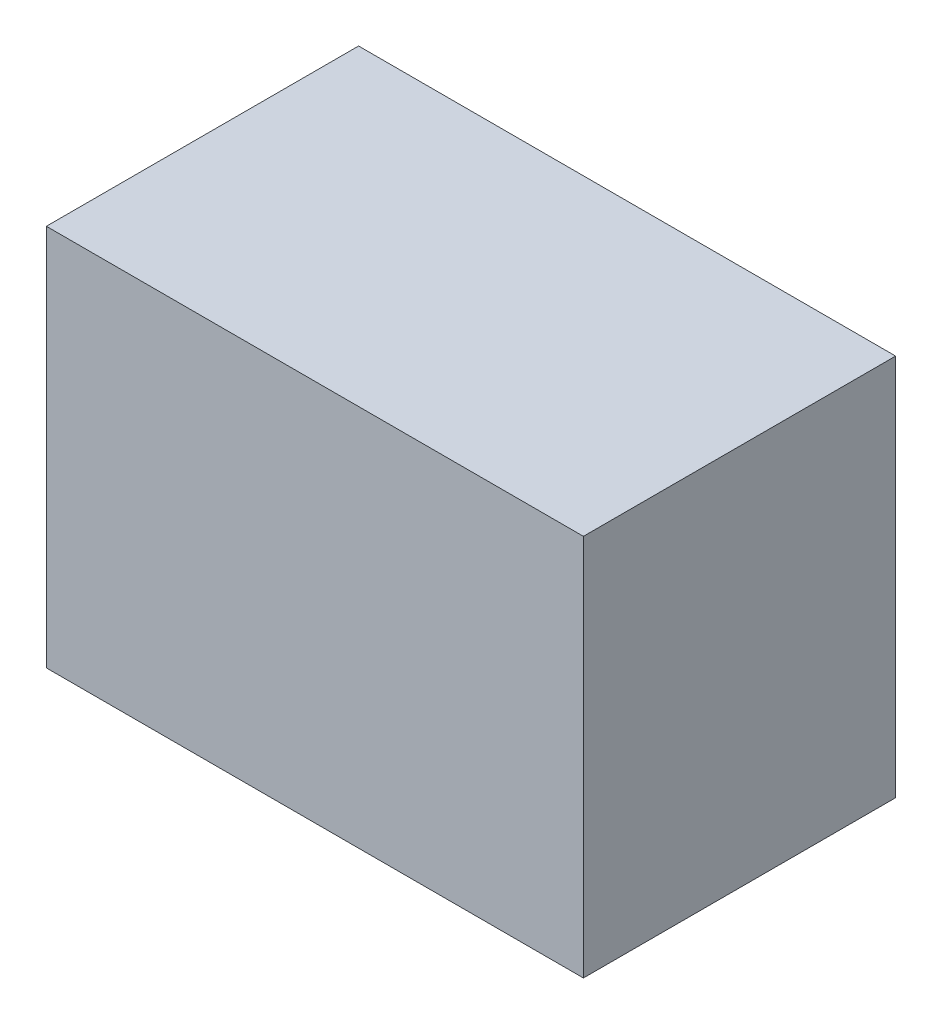
ISO-10303-21;
HEADER;
FILE_DESCRIPTION(('STEP AP214'),'2;1');
FILE_NAME('part.step','',(''),(''),'','','');
FILE_SCHEMA(('AUTOMOTIVE_DESIGN { 1 0 10303 214 1 1 1 1 }'));
ENDSEC;
DATA;
#1=APPLICATION_CONTEXT('core data for automotive mechanical design processes');
#2=APPLICATION_PROTOCOL_DEFINITION('international standard','automotive_design',2000,#1);
#3=PRODUCT_CONTEXT('',#1,'mechanical');
#4=PRODUCT('Part','Part','',(#3));
#5=PRODUCT_RELATED_PRODUCT_CATEGORY('part','',(#4));
#6=PRODUCT_DEFINITION_FORMATION('','',#4);
#7=PRODUCT_DEFINITION_CONTEXT('part definition',#1,'design');
#8=PRODUCT_DEFINITION('design','',#6,#7);
#9=PRODUCT_DEFINITION_SHAPE('','',#8);
#10=(LENGTH_UNIT() NAMED_UNIT(*) SI_UNIT(.MILLI.,.METRE.));
#11=(NAMED_UNIT(*) PLANE_ANGLE_UNIT() SI_UNIT($,.RADIAN.));
#12=(NAMED_UNIT(*) SI_UNIT($,.STERADIAN.) SOLID_ANGLE_UNIT());
#13=UNCERTAINTY_MEASURE_WITH_UNIT(LENGTH_MEASURE(1.E-05),#10,'distance_accuracy_value','');
#14=(GEOMETRIC_REPRESENTATION_CONTEXT(3) GLOBAL_UNCERTAINTY_ASSIGNED_CONTEXT((#13)) GLOBAL_UNIT_ASSIGNED_CONTEXT((#10,
#11,#12)) REPRESENTATION_CONTEXT('',''));
#15=CARTESIAN_POINT('',(0.,0.,0.));
#16=DIRECTION('',(0.,0.,1.));
#17=DIRECTION('',(1.,0.,0.));
#18=AXIS2_PLACEMENT_3D('',#15,#16,#17);
#19=CARTESIAN_POINT('',(-12.81449812,9.12699978,14.9));
#20=DIRECTION('',(0.,0.,1.));
#21=DIRECTION('',(1.,0.,0.));
#22=AXIS2_PLACEMENT_3D('',#19,#20,#21);
#23=PLANE('',#22);
#24=DIRECTION('',(0.,1.,0.));
#25=VECTOR('',#24,1.);
#26=CARTESIAN_POINT('',(12.81450066,9.12699978,14.9));
#27=LINE('',#26,#25);
#28=CARTESIAN_POINT('',(12.81450066,9.12699978,14.9));
#29=VERTEX_POINT('',#28);
#30=CARTESIAN_POINT('',(12.81450066,-9.12699978,14.9));
#31=VERTEX_POINT('',#30);
#32=EDGE_CURVE('E52',#29,#31,#27,.F.);
#33=ORIENTED_EDGE('',*,*,#32,.F.);
#34=DIRECTION('',(1.,0.,0.));
#35=VECTOR('',#34,1.);
#36=CARTESIAN_POINT('',(-12.81449812,9.12699978,14.9));
#37=LINE('',#36,#35);
#38=CARTESIAN_POINT('',(-12.81449812,9.12699978,14.9));
#39=VERTEX_POINT('',#38);
#40=EDGE_CURVE('E67',#39,#29,#37,.T.);
#41=ORIENTED_EDGE('',*,*,#40,.F.);
#42=DIRECTION('',(0.,1.,0.));
#43=VECTOR('',#42,1.);
#44=CARTESIAN_POINT('',(-12.81449812,-9.12699978,14.9));
#45=LINE('',#44,#43);
#46=CARTESIAN_POINT('',(-12.81449812,-9.12699978,14.9));
#47=VERTEX_POINT('',#46);
#48=EDGE_CURVE('E19',#47,#39,#45,.T.);
#49=ORIENTED_EDGE('',*,*,#48,.F.);
#50=DIRECTION('',(1.,0.,0.));
#51=VECTOR('',#50,1.);
#52=CARTESIAN_POINT('',(12.81450066,-9.12699978,14.9));
#53=LINE('',#52,#51);
#54=EDGE_CURVE('E57',#31,#47,#53,.F.);
#55=ORIENTED_EDGE('',*,*,#54,.F.);
#56=EDGE_LOOP('',(#33,#41,#49,#55));
#57=FACE_BOUND('',#56,.T.);
#58=ADVANCED_FACE('F16',(#57),#23,.T.);
#59=CARTESIAN_POINT('',(-12.81449812,-9.12699978,0.));
#60=DIRECTION('',(-1.,0.,0.));
#61=DIRECTION('',(0.,0.,1.));
#62=AXIS2_PLACEMENT_3D('',#59,#60,#61);
#63=PLANE('',#62);
#64=DIRECTION('',(0.,0.,1.));
#65=VECTOR('',#64,1.);
#66=CARTESIAN_POINT('',(-12.81449812,9.12699978,0.));
#67=LINE('',#66,#65);
#68=CARTESIAN_POINT('',(-12.81449812,9.12699978,0.));
#69=VERTEX_POINT('',#68);
#70=EDGE_CURVE('E78',#69,#39,#67,.T.);
#71=ORIENTED_EDGE('',*,*,#70,.F.);
#72=DIRECTION('',(0.,1.,0.));
#73=VECTOR('',#72,1.);
#74=CARTESIAN_POINT('',(-12.81449812,9.12699978,0.));
#75=LINE('',#74,#73);
#76=CARTESIAN_POINT('',(-12.81449812,-9.12699978,0.));
#77=VERTEX_POINT('',#76);
#78=EDGE_CURVE('E73',#69,#77,#75,.F.);
#79=ORIENTED_EDGE('',*,*,#78,.T.);
#80=DIRECTION('',(0.,0.,-1.));
#81=VECTOR('',#80,1.);
#82=CARTESIAN_POINT('',(-12.81449812,-9.12699978,0.));
#83=LINE('',#82,#81);
#84=EDGE_CURVE('E62',#47,#77,#83,.T.);
#85=ORIENTED_EDGE('',*,*,#84,.F.);
#86=ORIENTED_EDGE('',*,*,#48,.T.);
#87=EDGE_LOOP('',(#71,#79,#85,#86));
#88=FACE_BOUND('',#87,.T.);
#89=ADVANCED_FACE('F72',(#88),#63,.T.);
#90=CARTESIAN_POINT('',(12.81450066,-9.12699978,0.));
#91=DIRECTION('',(0.,-1.,0.));
#92=DIRECTION('',(0.,0.,-1.));
#93=AXIS2_PLACEMENT_3D('',#90,#91,#92);
#94=PLANE('',#93);
#95=ORIENTED_EDGE('',*,*,#84,.T.);
#96=DIRECTION('',(1.,0.,0.));
#97=VECTOR('',#96,1.);
#98=CARTESIAN_POINT('',(-12.81449812,-9.12699978,0.));
#99=LINE('',#98,#97);
#100=CARTESIAN_POINT('',(12.81450066,-9.12699978,0.));
#101=VERTEX_POINT('',#100);
#102=EDGE_CURVE('E83',#77,#101,#99,.T.);
#103=ORIENTED_EDGE('',*,*,#102,.T.);
#104=DIRECTION('',(0.,0.,-1.));
#105=VECTOR('',#104,1.);
#106=CARTESIAN_POINT('',(12.81450066,-9.12699978,0.));
#107=LINE('',#106,#105);
#108=EDGE_CURVE('E64',#31,#101,#107,.T.);
#109=ORIENTED_EDGE('',*,*,#108,.F.);
#110=ORIENTED_EDGE('',*,*,#54,.T.);
#111=EDGE_LOOP('',(#95,#103,#109,#110));
#112=FACE_BOUND('',#111,.T.);
#113=ADVANCED_FACE('F59',(#112),#94,.T.);
#114=CARTESIAN_POINT('',(12.81450066,9.12699978,0.));
#115=DIRECTION('',(1.,0.,0.));
#116=DIRECTION('',(0.,0.,-1.));
#117=AXIS2_PLACEMENT_3D('',#114,#115,#116);
#118=PLANE('',#117);
#119=ORIENTED_EDGE('',*,*,#108,.T.);
#120=DIRECTION('',(0.,1.,0.));
#121=VECTOR('',#120,1.);
#122=CARTESIAN_POINT('',(12.81450066,9.12699978,0.));
#123=LINE('',#122,#121);
#124=CARTESIAN_POINT('',(12.81450066,9.12699978,0.));
#125=VERTEX_POINT('',#124);
#126=EDGE_CURVE('E25',#101,#125,#123,.T.);
#127=ORIENTED_EDGE('',*,*,#126,.T.);
#128=DIRECTION('',(0.,0.,1.));
#129=VECTOR('',#128,1.);
#130=CARTESIAN_POINT('',(12.81450066,9.12699978,0.));
#131=LINE('',#130,#129);
#132=EDGE_CURVE('E33',#29,#125,#131,.F.);
#133=ORIENTED_EDGE('',*,*,#132,.F.);
#134=ORIENTED_EDGE('',*,*,#32,.T.);
#135=EDGE_LOOP('',(#119,#127,#133,#134));
#136=FACE_BOUND('',#135,.T.);
#137=ADVANCED_FACE('F87',(#136),#118,.T.);
#138=CARTESIAN_POINT('',(-12.81449812,9.12699978,0.));
#139=DIRECTION('',(0.,1.,0.));
#140=DIRECTION('',(0.,0.,1.));
#141=AXIS2_PLACEMENT_3D('',#138,#139,#140);
#142=PLANE('',#141);
#143=ORIENTED_EDGE('',*,*,#132,.T.);
#144=DIRECTION('',(1.,0.,0.));
#145=VECTOR('',#144,1.);
#146=CARTESIAN_POINT('',(-12.81449812,9.12699978,0.));
#147=LINE('',#146,#145);
#148=EDGE_CURVE('E11',#125,#69,#147,.F.);
#149=ORIENTED_EDGE('',*,*,#148,.T.);
#150=ORIENTED_EDGE('',*,*,#70,.T.);
#151=ORIENTED_EDGE('',*,*,#40,.T.);
#152=EDGE_LOOP('',(#143,#149,#150,#151));
#153=FACE_BOUND('',#152,.T.);
#154=ADVANCED_FACE('F90',(#153),#142,.T.);
#155=CARTESIAN_POINT('',(-12.81449812,9.12699978,0.));
#156=DIRECTION('',(0.,0.,1.));
#157=DIRECTION('',(1.,0.,0.));
#158=AXIS2_PLACEMENT_3D('',#155,#156,#157);
#159=PLANE('',#158);
#160=ORIENTED_EDGE('',*,*,#126,.F.);
#161=ORIENTED_EDGE('',*,*,#102,.F.);
#162=ORIENTED_EDGE('',*,*,#78,.F.);
#163=ORIENTED_EDGE('',*,*,#148,.F.);
#164=EDGE_LOOP('',(#160,#161,#162,#163));
#165=FACE_BOUND('',#164,.T.);
#166=ADVANCED_FACE('F89',(#165),#159,.F.);
#167=CLOSED_SHELL('',(#58,#89,#113,#137,#154,#166));
#168=MANIFOLD_SOLID_BREP('B1',#167);
#169=ADVANCED_BREP_SHAPE_REPRESENTATION('',(#18,#168),#14);
#170=SHAPE_DEFINITION_REPRESENTATION(#9,#169);
ENDSEC;
END-ISO-10303-21;
